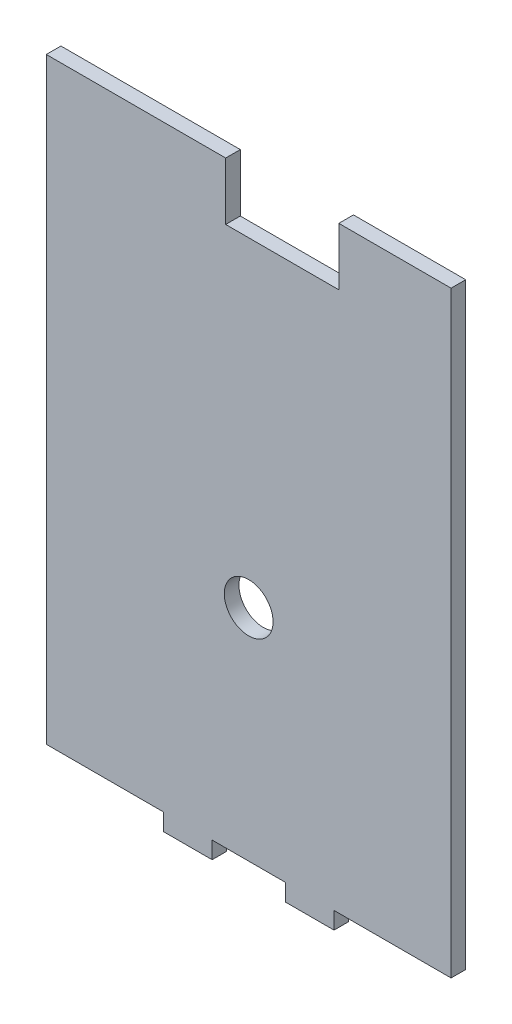
ISO-10303-21;
HEADER;
FILE_DESCRIPTION(('STEP AP214'),'2;1');
FILE_NAME('part.step','',(''),(''),'','','');
FILE_SCHEMA(('AUTOMOTIVE_DESIGN { 1 0 10303 214 1 1 1 1 }'));
ENDSEC;
DATA;
#1=APPLICATION_CONTEXT('core data for automotive mechanical design processes');
#2=APPLICATION_PROTOCOL_DEFINITION('international standard','automotive_design',2000,#1);
#3=PRODUCT_CONTEXT('',#1,'mechanical');
#4=PRODUCT('Part','Part','',(#3));
#5=PRODUCT_RELATED_PRODUCT_CATEGORY('part','',(#4));
#6=PRODUCT_DEFINITION_FORMATION('','',#4);
#7=PRODUCT_DEFINITION_CONTEXT('part definition',#1,'design');
#8=PRODUCT_DEFINITION('design','',#6,#7);
#9=PRODUCT_DEFINITION_SHAPE('','',#8);
#10=(LENGTH_UNIT() NAMED_UNIT(*) SI_UNIT(.MILLI.,.METRE.));
#11=(NAMED_UNIT(*) PLANE_ANGLE_UNIT() SI_UNIT($,.RADIAN.));
#12=(NAMED_UNIT(*) SI_UNIT($,.STERADIAN.) SOLID_ANGLE_UNIT());
#13=UNCERTAINTY_MEASURE_WITH_UNIT(LENGTH_MEASURE(1.E-05),#10,'distance_accuracy_value','');
#14=(GEOMETRIC_REPRESENTATION_CONTEXT(3) GLOBAL_UNCERTAINTY_ASSIGNED_CONTEXT((#13)) GLOBAL_UNIT_ASSIGNED_CONTEXT((#10,
#11,#12)) REPRESENTATION_CONTEXT('',''));
#15=CARTESIAN_POINT('',(0.,0.,0.));
#16=DIRECTION('',(0.,0.,1.));
#17=DIRECTION('',(1.,0.,0.));
#18=AXIS2_PLACEMENT_3D('',#15,#16,#17);
#19=CARTESIAN_POINT('',(0.,0.,3.));
#20=DIRECTION('',(0.,0.,-1.));
#21=DIRECTION('',(-1.,0.,0.));
#22=AXIS2_PLACEMENT_3D('',#19,#20,#21);
#23=PLANE('',#22);
#24=DIRECTION('',(0.,1.,0.));
#25=VECTOR('',#24,1.);
#26=CARTESIAN_POINT('',(81.1212226805782,81.82151488,3.));
#27=LINE('',#26,#25);
#28=CARTESIAN_POINT('',(81.1212226805782,-40.67848512,3.));
#29=VERTEX_POINT('',#28);
#30=CARTESIAN_POINT('',(81.1212226805782,81.82151488,3.));
#31=VERTEX_POINT('',#30);
#32=EDGE_CURVE('E210',#29,#31,#27,.T.);
#33=ORIENTED_EDGE('',*,*,#32,.T.);
#34=DIRECTION('',(-1.,0.,0.));
#35=VECTOR('',#34,1.);
#36=CARTESIAN_POINT('',(81.1212226805782,81.82151488,3.));
#37=LINE('',#36,#35);
#38=CARTESIAN_POINT('',(58.1024389801613,81.82151488,3.));
#39=VERTEX_POINT('',#38);
#40=EDGE_CURVE('E117',#31,#39,#37,.T.);
#41=ORIENTED_EDGE('',*,*,#40,.T.);
#42=DIRECTION('',(0.,-1.,0.));
#43=VECTOR('',#42,1.);
#44=CARTESIAN_POINT('',(58.1024389801613,81.82151488,3.));
#45=LINE('',#44,#43);
#46=CARTESIAN_POINT('',(58.1024389801613,70.02151488,3.));
#47=VERTEX_POINT('',#46);
#48=EDGE_CURVE('E249',#39,#47,#45,.T.);
#49=ORIENTED_EDGE('',*,*,#48,.T.);
#50=DIRECTION('',(-1.,0.,0.));
#51=VECTOR('',#50,1.);
#52=CARTESIAN_POINT('',(58.1024389801613,70.02151488,3.));
#53=LINE('',#52,#51);
#54=CARTESIAN_POINT('',(34.9024389801612,70.02151488,3.));
#55=VERTEX_POINT('',#54);
#56=EDGE_CURVE('E267',#47,#55,#53,.T.);
#57=ORIENTED_EDGE('',*,*,#56,.T.);
#58=DIRECTION('',(0.,1.,0.));
#59=VECTOR('',#58,1.);
#60=CARTESIAN_POINT('',(34.9024389801612,70.02151488,3.));
#61=LINE('',#60,#59);
#62=CARTESIAN_POINT('',(34.9024389801612,81.82151488,3.));
#63=VERTEX_POINT('',#62);
#64=EDGE_CURVE('E264',#55,#63,#61,.T.);
#65=ORIENTED_EDGE('',*,*,#64,.T.);
#66=DIRECTION('',(-1.,0.,0.));
#67=VECTOR('',#66,1.);
#68=CARTESIAN_POINT('',(34.9024389801612,81.82151488,3.));
#69=LINE('',#68,#67);
#70=CARTESIAN_POINT('',(-1.87877815467746,81.82151488,3.));
#71=VERTEX_POINT('',#70);
#72=EDGE_CURVE('E266',#63,#71,#69,.T.);
#73=ORIENTED_EDGE('',*,*,#72,.T.);
#74=DIRECTION('',(0.,-1.,0.));
#75=VECTOR('',#74,1.);
#76=CARTESIAN_POINT('',(-1.87877815467746,81.82151488,3.));
#77=LINE('',#76,#75);
#78=CARTESIAN_POINT('',(-1.87877815467746,-40.67848512,3.));
#79=VERTEX_POINT('',#78);
#80=EDGE_CURVE('E269',#71,#79,#77,.T.);
#81=ORIENTED_EDGE('',*,*,#80,.T.);
#82=DIRECTION('',(1.,0.,0.));
#83=VECTOR('',#82,1.);
#84=CARTESIAN_POINT('',(22.1212222629502,-40.67848512,3.));
#85=LINE('',#84,#83);
#86=CARTESIAN_POINT('',(22.1212222629502,-40.67848512,3.));
#87=VERTEX_POINT('',#86);
#88=EDGE_CURVE('E275',#79,#87,#85,.T.);
#89=ORIENTED_EDGE('',*,*,#88,.T.);
#90=DIRECTION('',(0.,-1.,0.));
#91=VECTOR('',#90,1.);
#92=CARTESIAN_POINT('',(22.1212222629504,-44.17848512,3.));
#93=LINE('',#92,#91);
#94=CARTESIAN_POINT('',(22.1212222629504,-44.17848512,3.));
#95=VERTEX_POINT('',#94);
#96=EDGE_CURVE('E277',#87,#95,#93,.T.);
#97=ORIENTED_EDGE('',*,*,#96,.T.);
#98=DIRECTION('',(1.,0.,0.));
#99=VECTOR('',#98,1.);
#100=CARTESIAN_POINT('',(32.1212222629504,-44.17848512,3.));
#101=LINE('',#100,#99);
#102=CARTESIAN_POINT('',(32.1212222629504,-44.17848512,3.));
#103=VERTEX_POINT('',#102);
#104=EDGE_CURVE('E279',#95,#103,#101,.T.);
#105=ORIENTED_EDGE('',*,*,#104,.T.);
#106=DIRECTION('',(0.,1.,0.));
#107=VECTOR('',#106,1.);
#108=CARTESIAN_POINT('',(32.1212222629504,-40.67848512,3.));
#109=LINE('',#108,#107);
#110=CARTESIAN_POINT('',(32.1212222629504,-40.67848512,3.));
#111=VERTEX_POINT('',#110);
#112=EDGE_CURVE('E281',#103,#111,#109,.T.);
#113=ORIENTED_EDGE('',*,*,#112,.T.);
#114=DIRECTION('',(1.,0.,0.));
#115=VECTOR('',#114,1.);
#116=CARTESIAN_POINT('',(47.1212222629503,-40.67848512,3.));
#117=LINE('',#116,#115);
#118=CARTESIAN_POINT('',(47.1212222629503,-40.67848512,3.));
#119=VERTEX_POINT('',#118);
#120=EDGE_CURVE('E283',#111,#119,#117,.T.);
#121=ORIENTED_EDGE('',*,*,#120,.T.);
#122=DIRECTION('',(0.,-1.,0.));
#123=VECTOR('',#122,1.);
#124=CARTESIAN_POINT('',(47.1212222629503,-44.17848512,3.));
#125=LINE('',#124,#123);
#126=CARTESIAN_POINT('',(47.1212222629503,-44.17848512,3.));
#127=VERTEX_POINT('',#126);
#128=EDGE_CURVE('E160',#119,#127,#125,.T.);
#129=ORIENTED_EDGE('',*,*,#128,.T.);
#130=DIRECTION('',(1.,0.,0.));
#131=VECTOR('',#130,1.);
#132=CARTESIAN_POINT('',(57.1212222629503,-44.17848512,3.));
#133=LINE('',#132,#131);
#134=CARTESIAN_POINT('',(57.1212222629503,-44.17848512,3.));
#135=VERTEX_POINT('',#134);
#136=EDGE_CURVE('E154',#127,#135,#133,.T.);
#137=ORIENTED_EDGE('',*,*,#136,.T.);
#138=DIRECTION('',(0.,1.,0.));
#139=VECTOR('',#138,1.);
#140=CARTESIAN_POINT('',(57.1212222629503,-40.67848512,3.));
#141=LINE('',#140,#139);
#142=CARTESIAN_POINT('',(57.1212222629503,-40.67848512,3.));
#143=VERTEX_POINT('',#142);
#144=EDGE_CURVE('E158',#135,#143,#141,.T.);
#145=ORIENTED_EDGE('',*,*,#144,.T.);
#146=DIRECTION('',(1.,0.,0.));
#147=VECTOR('',#146,1.);
#148=CARTESIAN_POINT('',(81.1212226805782,-40.67848512,3.));
#149=LINE('',#148,#147);
#150=EDGE_CURVE('E50',#143,#29,#149,.T.);
#151=ORIENTED_EDGE('',*,*,#150,.T.);
#152=EDGE_LOOP('',(#33,#41,#49,#57,#65,#73,#81,#89,#97,#105,#113,#121,#129,#137,#145,#151));
#153=FACE_BOUND('',#152,.T.);
#154=CARTESIAN_POINT('',(39.6212226805782,4.32151488000002,3.));
#155=DIRECTION('',(0.,0.,1.));
#156=DIRECTION('',(1.,0.,0.));
#157=AXIS2_PLACEMENT_3D('',#154,#155,#156);
#158=CIRCLE('',#157,5.);
#159=CARTESIAN_POINT('',(44.6212226805782,4.32151488000002,3.));
#160=VERTEX_POINT('',#159);
#161=EDGE_CURVE('E182',#160,#160,#158,.T.);
#162=ORIENTED_EDGE('',*,*,#161,.F.);
#163=EDGE_LOOP('',(#162));
#164=FACE_BOUND('',#163,.T.);
#165=ADVANCED_FACE('F33',(#153,#164),#23,.F.);
#166=CARTESIAN_POINT('',(0.,0.,0.));
#167=DIRECTION('',(0.,0.,-1.));
#168=DIRECTION('',(-1.,0.,0.));
#169=AXIS2_PLACEMENT_3D('',#166,#167,#168);
#170=PLANE('',#169);
#171=DIRECTION('',(0.,1.,0.));
#172=VECTOR('',#171,1.);
#173=CARTESIAN_POINT('',(81.1212226805782,81.82151488,0.));
#174=LINE('',#173,#172);
#175=CARTESIAN_POINT('',(81.1212226805782,-40.67848512,0.));
#176=VERTEX_POINT('',#175);
#177=CARTESIAN_POINT('',(81.1212226805782,81.82151488,0.));
#178=VERTEX_POINT('',#177);
#179=EDGE_CURVE('E178',#176,#178,#174,.T.);
#180=ORIENTED_EDGE('',*,*,#179,.F.);
#181=DIRECTION('',(1.,0.,0.));
#182=VECTOR('',#181,1.);
#183=CARTESIAN_POINT('',(81.1212226805782,-40.67848512,0.));
#184=LINE('',#183,#182);
#185=CARTESIAN_POINT('',(57.1212222629503,-40.67848512,0.));
#186=VERTEX_POINT('',#185);
#187=EDGE_CURVE('E109',#186,#176,#184,.T.);
#188=ORIENTED_EDGE('',*,*,#187,.F.);
#189=DIRECTION('',(0.,1.,0.));
#190=VECTOR('',#189,1.);
#191=CARTESIAN_POINT('',(57.1212222629503,-40.67848512,0.));
#192=LINE('',#191,#190);
#193=CARTESIAN_POINT('',(57.1212222629503,-44.17848512,0.));
#194=VERTEX_POINT('',#193);
#195=EDGE_CURVE('E103',#194,#186,#192,.T.);
#196=ORIENTED_EDGE('',*,*,#195,.F.);
#197=DIRECTION('',(1.,0.,0.));
#198=VECTOR('',#197,1.);
#199=CARTESIAN_POINT('',(57.1212222629503,-44.17848512,0.));
#200=LINE('',#199,#198);
#201=CARTESIAN_POINT('',(47.1212222629503,-44.17848512,0.));
#202=VERTEX_POINT('',#201);
#203=EDGE_CURVE('E168',#202,#194,#200,.T.);
#204=ORIENTED_EDGE('',*,*,#203,.F.);
#205=DIRECTION('',(0.,-1.,0.));
#206=VECTOR('',#205,1.);
#207=CARTESIAN_POINT('',(47.1212222629503,-44.17848512,0.));
#208=LINE('',#207,#206);
#209=CARTESIAN_POINT('',(47.1212222629503,-40.67848512,0.));
#210=VERTEX_POINT('',#209);
#211=EDGE_CURVE('E205',#210,#202,#208,.T.);
#212=ORIENTED_EDGE('',*,*,#211,.F.);
#213=DIRECTION('',(1.,0.,0.));
#214=VECTOR('',#213,1.);
#215=CARTESIAN_POINT('',(47.1212222629503,-40.67848512,0.));
#216=LINE('',#215,#214);
#217=CARTESIAN_POINT('',(32.1212222629504,-40.67848512,0.));
#218=VERTEX_POINT('',#217);
#219=EDGE_CURVE('E203',#218,#210,#216,.T.);
#220=ORIENTED_EDGE('',*,*,#219,.F.);
#221=DIRECTION('',(0.,1.,0.));
#222=VECTOR('',#221,1.);
#223=CARTESIAN_POINT('',(32.1212222629504,-40.67848512,0.));
#224=LINE('',#223,#222);
#225=CARTESIAN_POINT('',(32.1212222629504,-44.17848512,0.));
#226=VERTEX_POINT('',#225);
#227=EDGE_CURVE('E201',#226,#218,#224,.T.);
#228=ORIENTED_EDGE('',*,*,#227,.F.);
#229=DIRECTION('',(1.,0.,0.));
#230=VECTOR('',#229,1.);
#231=CARTESIAN_POINT('',(32.1212222629504,-44.17848512,0.));
#232=LINE('',#231,#230);
#233=CARTESIAN_POINT('',(22.1212222629504,-44.17848512,0.));
#234=VERTEX_POINT('',#233);
#235=EDGE_CURVE('E199',#234,#226,#232,.T.);
#236=ORIENTED_EDGE('',*,*,#235,.F.);
#237=DIRECTION('',(0.,-1.,0.));
#238=VECTOR('',#237,1.);
#239=CARTESIAN_POINT('',(22.1212222629504,-44.17848512,0.));
#240=LINE('',#239,#238);
#241=CARTESIAN_POINT('',(22.1212222629502,-40.67848512,0.));
#242=VERTEX_POINT('',#241);
#243=EDGE_CURVE('E197',#242,#234,#240,.T.);
#244=ORIENTED_EDGE('',*,*,#243,.F.);
#245=DIRECTION('',(1.,0.,0.));
#246=VECTOR('',#245,1.);
#247=CARTESIAN_POINT('',(22.1212222629502,-40.67848512,0.));
#248=LINE('',#247,#246);
#249=CARTESIAN_POINT('',(-1.87877815467746,-40.67848512,0.));
#250=VERTEX_POINT('',#249);
#251=EDGE_CURVE('E195',#250,#242,#248,.T.);
#252=ORIENTED_EDGE('',*,*,#251,.F.);
#253=DIRECTION('',(0.,-1.,0.));
#254=VECTOR('',#253,1.);
#255=CARTESIAN_POINT('',(-1.87877815467746,81.82151488,0.));
#256=LINE('',#255,#254);
#257=CARTESIAN_POINT('',(-1.87877815467746,81.82151488,0.));
#258=VERTEX_POINT('',#257);
#259=EDGE_CURVE('E193',#258,#250,#256,.T.);
#260=ORIENTED_EDGE('',*,*,#259,.F.);
#261=DIRECTION('',(-1.,0.,0.));
#262=VECTOR('',#261,1.);
#263=CARTESIAN_POINT('',(19.6946966174781,81.82151488,0.));
#264=LINE('',#263,#262);
#265=CARTESIAN_POINT('',(34.9024389801612,81.82151488,0.));
#266=VERTEX_POINT('',#265);
#267=EDGE_CURVE('E191',#266,#258,#264,.T.);
#268=ORIENTED_EDGE('',*,*,#267,.F.);
#269=DIRECTION('',(0.,1.,0.));
#270=VECTOR('',#269,1.);
#271=CARTESIAN_POINT('',(34.9024389801612,70.02151488,0.));
#272=LINE('',#271,#270);
#273=CARTESIAN_POINT('',(34.9024389801612,70.02151488,0.));
#274=VERTEX_POINT('',#273);
#275=EDGE_CURVE('E188',#274,#266,#272,.T.);
#276=ORIENTED_EDGE('',*,*,#275,.F.);
#277=DIRECTION('',(-1.,0.,0.));
#278=VECTOR('',#277,1.);
#279=CARTESIAN_POINT('',(58.1024389801613,70.02151488,0.));
#280=LINE('',#279,#278);
#281=CARTESIAN_POINT('',(58.1024389801613,70.02151488,0.));
#282=VERTEX_POINT('',#281);
#283=EDGE_CURVE('E186',#282,#274,#280,.T.);
#284=ORIENTED_EDGE('',*,*,#283,.F.);
#285=DIRECTION('',(0.,-1.,0.));
#286=VECTOR('',#285,1.);
#287=CARTESIAN_POINT('',(58.1024389801613,81.82151488,0.));
#288=LINE('',#287,#286);
#289=CARTESIAN_POINT('',(58.1024389801613,81.82151488,0.));
#290=VERTEX_POINT('',#289);
#291=EDGE_CURVE('E184',#290,#282,#288,.T.);
#292=ORIENTED_EDGE('',*,*,#291,.F.);
#293=DIRECTION('',(-1.,0.,0.));
#294=VECTOR('',#293,1.);
#295=CARTESIAN_POINT('',(70.1118308303698,81.82151488,0.));
#296=LINE('',#295,#294);
#297=EDGE_CURVE('E181',#178,#290,#296,.T.);
#298=ORIENTED_EDGE('',*,*,#297,.F.);
#299=EDGE_LOOP('',(#180,#188,#196,#204,#212,#220,#228,#236,#244,#252,#260,#268,#276,#284,#292,#298));
#300=FACE_BOUND('',#299,.T.);
#301=CARTESIAN_POINT('',(39.6212226805782,4.32151488000002,0.));
#302=DIRECTION('',(0.,0.,1.));
#303=DIRECTION('',(1.,0.,0.));
#304=AXIS2_PLACEMENT_3D('',#301,#302,#303);
#305=CIRCLE('',#304,5.);
#306=CARTESIAN_POINT('',(44.6212226805782,4.32151488000002,0.));
#307=VERTEX_POINT('',#306);
#308=EDGE_CURVE('E488',#307,#307,#305,.T.);
#309=ORIENTED_EDGE('',*,*,#308,.T.);
#310=EDGE_LOOP('',(#309));
#311=FACE_BOUND('',#310,.T.);
#312=ADVANCED_FACE('F253',(#300,#311),#170,.T.);
#313=CARTESIAN_POINT('',(81.1212226805782,81.82151488,3.));
#314=DIRECTION('',(-1.,0.,0.));
#315=DIRECTION('',(0.,0.,1.));
#316=AXIS2_PLACEMENT_3D('',#313,#314,#315);
#317=PLANE('',#316);
#318=ORIENTED_EDGE('',*,*,#179,.T.);
#319=DIRECTION('',(0.,0.,-1.));
#320=VECTOR('',#319,1.);
#321=CARTESIAN_POINT('',(81.1212226805782,81.82151488,3.));
#322=LINE('',#321,#320);
#323=EDGE_CURVE('E11',#31,#178,#322,.T.);
#324=ORIENTED_EDGE('',*,*,#323,.F.);
#325=ORIENTED_EDGE('',*,*,#32,.F.);
#326=DIRECTION('',(0.,0.,-1.));
#327=VECTOR('',#326,1.);
#328=CARTESIAN_POINT('',(81.1212226805782,-40.67848512,3.));
#329=LINE('',#328,#327);
#330=EDGE_CURVE('E174',#29,#176,#329,.T.);
#331=ORIENTED_EDGE('',*,*,#330,.T.);
#332=EDGE_LOOP('',(#318,#324,#325,#331));
#333=FACE_BOUND('',#332,.T.);
#334=ADVANCED_FACE('F35',(#333),#317,.F.);
#335=CARTESIAN_POINT('',(70.1118308303698,81.82151488,3.));
#336=DIRECTION('',(0.,-1.,0.));
#337=DIRECTION('',(0.,0.,-1.));
#338=AXIS2_PLACEMENT_3D('',#335,#336,#337);
#339=PLANE('',#338);
#340=ORIENTED_EDGE('',*,*,#297,.T.);
#341=DIRECTION('',(0.,0.,-1.));
#342=VECTOR('',#341,1.);
#343=CARTESIAN_POINT('',(58.1024389801613,81.82151488,3.));
#344=LINE('',#343,#342);
#345=EDGE_CURVE('E42',#39,#290,#344,.T.);
#346=ORIENTED_EDGE('',*,*,#345,.F.);
#347=ORIENTED_EDGE('',*,*,#40,.F.);
#348=ORIENTED_EDGE('',*,*,#323,.T.);
#349=EDGE_LOOP('',(#340,#346,#347,#348));
#350=FACE_BOUND('',#349,.T.);
#351=ADVANCED_FACE('F317',(#350),#339,.F.);
#352=CARTESIAN_POINT('',(58.1024389801613,81.82151488,3.));
#353=DIRECTION('',(1.,0.,0.));
#354=DIRECTION('',(0.,0.,-1.));
#355=AXIS2_PLACEMENT_3D('',#352,#353,#354);
#356=PLANE('',#355);
#357=ORIENTED_EDGE('',*,*,#291,.T.);
#358=DIRECTION('',(0.,0.,-1.));
#359=VECTOR('',#358,1.);
#360=CARTESIAN_POINT('',(58.1024389801613,70.02151488,3.));
#361=LINE('',#360,#359);
#362=EDGE_CURVE('E241',#47,#282,#361,.T.);
#363=ORIENTED_EDGE('',*,*,#362,.F.);
#364=ORIENTED_EDGE('',*,*,#48,.F.);
#365=ORIENTED_EDGE('',*,*,#345,.T.);
#366=EDGE_LOOP('',(#357,#363,#364,#365));
#367=FACE_BOUND('',#366,.T.);
#368=ADVANCED_FACE('F247',(#367),#356,.F.);
#369=CARTESIAN_POINT('',(58.1024389801613,70.02151488,3.));
#370=DIRECTION('',(0.,-1.,0.));
#371=DIRECTION('',(0.,0.,-1.));
#372=AXIS2_PLACEMENT_3D('',#369,#370,#371);
#373=PLANE('',#372);
#374=ORIENTED_EDGE('',*,*,#283,.T.);
#375=DIRECTION('',(0.,0.,-1.));
#376=VECTOR('',#375,1.);
#377=CARTESIAN_POINT('',(34.9024389801612,70.02151488,3.));
#378=LINE('',#377,#376);
#379=EDGE_CURVE('E238',#55,#274,#378,.T.);
#380=ORIENTED_EDGE('',*,*,#379,.F.);
#381=ORIENTED_EDGE('',*,*,#56,.F.);
#382=ORIENTED_EDGE('',*,*,#362,.T.);
#383=EDGE_LOOP('',(#374,#380,#381,#382));
#384=FACE_BOUND('',#383,.T.);
#385=ADVANCED_FACE('F258',(#384),#373,.F.);
#386=CARTESIAN_POINT('',(34.9024389801612,70.02151488,3.));
#387=DIRECTION('',(-1.,0.,0.));
#388=DIRECTION('',(0.,0.,1.));
#389=AXIS2_PLACEMENT_3D('',#386,#387,#388);
#390=PLANE('',#389);
#391=ORIENTED_EDGE('',*,*,#275,.T.);
#392=DIRECTION('',(0.,0.,-1.));
#393=VECTOR('',#392,1.);
#394=CARTESIAN_POINT('',(34.9024389801612,81.82151488,3.));
#395=LINE('',#394,#393);
#396=EDGE_CURVE('E235',#63,#266,#395,.T.);
#397=ORIENTED_EDGE('',*,*,#396,.F.);
#398=ORIENTED_EDGE('',*,*,#64,.F.);
#399=ORIENTED_EDGE('',*,*,#379,.T.);
#400=EDGE_LOOP('',(#391,#397,#398,#399));
#401=FACE_BOUND('',#400,.T.);
#402=ADVANCED_FACE('F262',(#401),#390,.F.);
#403=CARTESIAN_POINT('',(19.6946966174781,81.82151488,3.));
#404=DIRECTION('',(0.,-1.,0.));
#405=DIRECTION('',(0.,0.,-1.));
#406=AXIS2_PLACEMENT_3D('',#403,#404,#405);
#407=PLANE('',#406);
#408=ORIENTED_EDGE('',*,*,#267,.T.);
#409=DIRECTION('',(0.,0.,-1.));
#410=VECTOR('',#409,1.);
#411=CARTESIAN_POINT('',(-1.87877815467746,81.82151488,3.));
#412=LINE('',#411,#410);
#413=EDGE_CURVE('E232',#71,#258,#412,.T.);
#414=ORIENTED_EDGE('',*,*,#413,.F.);
#415=ORIENTED_EDGE('',*,*,#72,.F.);
#416=ORIENTED_EDGE('',*,*,#396,.T.);
#417=EDGE_LOOP('',(#408,#414,#415,#416));
#418=FACE_BOUND('',#417,.T.);
#419=ADVANCED_FACE('F330',(#418),#407,.F.);
#420=CARTESIAN_POINT('',(-1.87877815467746,81.82151488,3.));
#421=DIRECTION('',(1.,0.,0.));
#422=DIRECTION('',(0.,0.,-1.));
#423=AXIS2_PLACEMENT_3D('',#420,#421,#422);
#424=PLANE('',#423);
#425=ORIENTED_EDGE('',*,*,#259,.T.);
#426=DIRECTION('',(0.,0.,-1.));
#427=VECTOR('',#426,1.);
#428=CARTESIAN_POINT('',(-1.87877815467746,-40.67848512,3.));
#429=LINE('',#428,#427);
#430=EDGE_CURVE('E229',#79,#250,#429,.T.);
#431=ORIENTED_EDGE('',*,*,#430,.F.);
#432=ORIENTED_EDGE('',*,*,#80,.F.);
#433=ORIENTED_EDGE('',*,*,#413,.T.);
#434=EDGE_LOOP('',(#425,#431,#432,#433));
#435=FACE_BOUND('',#434,.T.);
#436=ADVANCED_FACE('F333',(#435),#424,.F.);
#437=CARTESIAN_POINT('',(22.1212222629502,-40.67848512,3.));
#438=DIRECTION('',(0.,1.,0.));
#439=DIRECTION('',(0.,0.,1.));
#440=AXIS2_PLACEMENT_3D('',#437,#438,#439);
#441=PLANE('',#440);
#442=ORIENTED_EDGE('',*,*,#251,.T.);
#443=DIRECTION('',(0.,0.,-1.));
#444=VECTOR('',#443,1.);
#445=CARTESIAN_POINT('',(22.1212222629502,-40.67848512,3.));
#446=LINE('',#445,#444);
#447=EDGE_CURVE('E226',#87,#242,#446,.T.);
#448=ORIENTED_EDGE('',*,*,#447,.F.);
#449=ORIENTED_EDGE('',*,*,#88,.F.);
#450=ORIENTED_EDGE('',*,*,#430,.T.);
#451=EDGE_LOOP('',(#442,#448,#449,#450));
#452=FACE_BOUND('',#451,.T.);
#453=ADVANCED_FACE('F337',(#452),#441,.F.);
#454=CARTESIAN_POINT('',(22.1212222629504,-44.17848512,3.));
#455=DIRECTION('',(1.,0.,0.));
#456=DIRECTION('',(0.,1.,0.));
#457=AXIS2_PLACEMENT_3D('',#454,#455,#456);
#458=PLANE('',#457);
#459=ORIENTED_EDGE('',*,*,#243,.T.);
#460=DIRECTION('',(0.,0.,-1.));
#461=VECTOR('',#460,1.);
#462=CARTESIAN_POINT('',(22.1212222629504,-44.17848512,3.));
#463=LINE('',#462,#461);
#464=EDGE_CURVE('E223',#95,#234,#463,.T.);
#465=ORIENTED_EDGE('',*,*,#464,.F.);
#466=ORIENTED_EDGE('',*,*,#96,.F.);
#467=ORIENTED_EDGE('',*,*,#447,.T.);
#468=EDGE_LOOP('',(#459,#465,#466,#467));
#469=FACE_BOUND('',#468,.T.);
#470=ADVANCED_FACE('F341',(#469),#458,.F.);
#471=CARTESIAN_POINT('',(32.1212222629504,-44.17848512,3.));
#472=DIRECTION('',(0.,1.,0.));
#473=DIRECTION('',(0.,0.,1.));
#474=AXIS2_PLACEMENT_3D('',#471,#472,#473);
#475=PLANE('',#474);
#476=ORIENTED_EDGE('',*,*,#235,.T.);
#477=DIRECTION('',(0.,0.,-1.));
#478=VECTOR('',#477,1.);
#479=CARTESIAN_POINT('',(32.1212222629504,-44.17848512,3.));
#480=LINE('',#479,#478);
#481=EDGE_CURVE('E220',#103,#226,#480,.T.);
#482=ORIENTED_EDGE('',*,*,#481,.F.);
#483=ORIENTED_EDGE('',*,*,#104,.F.);
#484=ORIENTED_EDGE('',*,*,#464,.T.);
#485=EDGE_LOOP('',(#476,#482,#483,#484));
#486=FACE_BOUND('',#485,.T.);
#487=ADVANCED_FACE('F345',(#486),#475,.F.);
#488=CARTESIAN_POINT('',(32.1212222629504,-40.67848512,3.));
#489=DIRECTION('',(-1.,0.,0.));
#490=DIRECTION('',(0.,0.,1.));
#491=AXIS2_PLACEMENT_3D('',#488,#489,#490);
#492=PLANE('',#491);
#493=ORIENTED_EDGE('',*,*,#227,.T.);
#494=DIRECTION('',(0.,0.,-1.));
#495=VECTOR('',#494,1.);
#496=CARTESIAN_POINT('',(32.1212222629504,-40.67848512,3.));
#497=LINE('',#496,#495);
#498=EDGE_CURVE('E217',#111,#218,#497,.T.);
#499=ORIENTED_EDGE('',*,*,#498,.F.);
#500=ORIENTED_EDGE('',*,*,#112,.F.);
#501=ORIENTED_EDGE('',*,*,#481,.T.);
#502=EDGE_LOOP('',(#493,#499,#500,#501));
#503=FACE_BOUND('',#502,.T.);
#504=ADVANCED_FACE('F349',(#503),#492,.F.);
#505=CARTESIAN_POINT('',(47.1212222629503,-40.67848512,3.));
#506=DIRECTION('',(0.,1.,0.));
#507=DIRECTION('',(0.,0.,1.));
#508=AXIS2_PLACEMENT_3D('',#505,#506,#507);
#509=PLANE('',#508);
#510=ORIENTED_EDGE('',*,*,#219,.T.);
#511=DIRECTION('',(0.,0.,-1.));
#512=VECTOR('',#511,1.);
#513=CARTESIAN_POINT('',(47.1212222629503,-40.67848512,3.));
#514=LINE('',#513,#512);
#515=EDGE_CURVE('E214',#119,#210,#514,.T.);
#516=ORIENTED_EDGE('',*,*,#515,.F.);
#517=ORIENTED_EDGE('',*,*,#120,.F.);
#518=ORIENTED_EDGE('',*,*,#498,.T.);
#519=EDGE_LOOP('',(#510,#516,#517,#518));
#520=FACE_BOUND('',#519,.T.);
#521=ADVANCED_FACE('F289',(#520),#509,.F.);
#522=CARTESIAN_POINT('',(47.1212222629503,-44.17848512,3.));
#523=DIRECTION('',(1.,0.,0.));
#524=DIRECTION('',(0.,0.,-1.));
#525=AXIS2_PLACEMENT_3D('',#522,#523,#524);
#526=PLANE('',#525);
#527=ORIENTED_EDGE('',*,*,#211,.T.);
#528=DIRECTION('',(0.,0.,-1.));
#529=VECTOR('',#528,1.);
#530=CARTESIAN_POINT('',(47.1212222629503,-44.17848512,3.));
#531=LINE('',#530,#529);
#532=EDGE_CURVE('E169',#127,#202,#531,.T.);
#533=ORIENTED_EDGE('',*,*,#532,.F.);
#534=ORIENTED_EDGE('',*,*,#128,.F.);
#535=ORIENTED_EDGE('',*,*,#515,.T.);
#536=EDGE_LOOP('',(#527,#533,#534,#535));
#537=FACE_BOUND('',#536,.T.);
#538=ADVANCED_FACE('F293',(#537),#526,.F.);
#539=CARTESIAN_POINT('',(57.1212222629503,-44.17848512,3.));
#540=DIRECTION('',(0.,1.,0.));
#541=DIRECTION('',(0.,0.,1.));
#542=AXIS2_PLACEMENT_3D('',#539,#540,#541);
#543=PLANE('',#542);
#544=ORIENTED_EDGE('',*,*,#203,.T.);
#545=DIRECTION('',(0.,0.,-1.));
#546=VECTOR('',#545,1.);
#547=CARTESIAN_POINT('',(57.1212222629503,-44.17848512,3.));
#548=LINE('',#547,#546);
#549=EDGE_CURVE('E165',#135,#194,#548,.T.);
#550=ORIENTED_EDGE('',*,*,#549,.F.);
#551=ORIENTED_EDGE('',*,*,#136,.F.);
#552=ORIENTED_EDGE('',*,*,#532,.T.);
#553=EDGE_LOOP('',(#544,#550,#551,#552));
#554=FACE_BOUND('',#553,.T.);
#555=ADVANCED_FACE('F166',(#554),#543,.F.);
#556=CARTESIAN_POINT('',(57.1212222629503,-40.67848512,3.));
#557=DIRECTION('',(-1.,0.,0.));
#558=DIRECTION('',(0.,0.,1.));
#559=AXIS2_PLACEMENT_3D('',#556,#557,#558);
#560=PLANE('',#559);
#561=ORIENTED_EDGE('',*,*,#195,.T.);
#562=DIRECTION('',(0.,0.,-1.));
#563=VECTOR('',#562,1.);
#564=CARTESIAN_POINT('',(57.1212222629503,-40.67848512,3.));
#565=LINE('',#564,#563);
#566=EDGE_CURVE('E170',#143,#186,#565,.T.);
#567=ORIENTED_EDGE('',*,*,#566,.F.);
#568=ORIENTED_EDGE('',*,*,#144,.F.);
#569=ORIENTED_EDGE('',*,*,#549,.T.);
#570=EDGE_LOOP('',(#561,#567,#568,#569));
#571=FACE_BOUND('',#570,.T.);
#572=ADVANCED_FACE('F172',(#571),#560,.F.);
#573=CARTESIAN_POINT('',(81.1212226805782,-40.67848512,3.));
#574=DIRECTION('',(0.,1.,0.));
#575=DIRECTION('',(0.,0.,1.));
#576=AXIS2_PLACEMENT_3D('',#573,#574,#575);
#577=PLANE('',#576);
#578=ORIENTED_EDGE('',*,*,#187,.T.);
#579=ORIENTED_EDGE('',*,*,#330,.F.);
#580=ORIENTED_EDGE('',*,*,#150,.F.);
#581=ORIENTED_EDGE('',*,*,#566,.T.);
#582=EDGE_LOOP('',(#578,#579,#580,#581));
#583=FACE_BOUND('',#582,.T.);
#584=ADVANCED_FACE('F297',(#583),#577,.F.);
#585=CARTESIAN_POINT('',(39.6212226805782,4.32151488000002,3.));
#586=DIRECTION('',(0.,0.,-1.));
#587=DIRECTION('',(-1.,0.,0.));
#588=AXIS2_PLACEMENT_3D('',#585,#586,#587);
#589=CYLINDRICAL_SURFACE('',#588,5.);
#590=ORIENTED_EDGE('',*,*,#161,.T.);
#591=EDGE_LOOP('',(#590));
#592=FACE_BOUND('',#591,.T.);
#593=ORIENTED_EDGE('',*,*,#308,.F.);
#594=EDGE_LOOP('',(#593));
#595=FACE_BOUND('',#594,.T.);
#596=ADVANCED_FACE('F299',(#592,#595),#589,.F.);
#597=CLOSED_SHELL('',(#165,#312,#334,#351,#368,#385,#402,#419,#436,#453,#470,#487,#504,#521,
#538,#555,#572,#584,#596));
#598=MANIFOLD_SOLID_BREP('B2',#597);
#599=ADVANCED_BREP_SHAPE_REPRESENTATION('',(#18,#598),#14);
#600=SHAPE_DEFINITION_REPRESENTATION(#9,#599);
ENDSEC;
END-ISO-10303-21;
